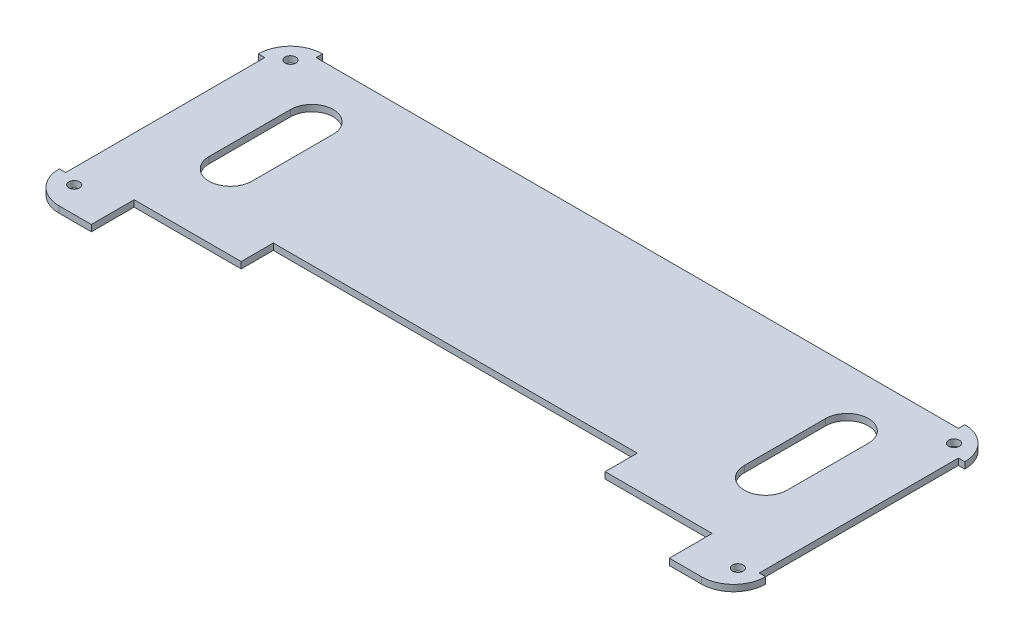
ISO-10303-21;
HEADER;
FILE_DESCRIPTION(('STEP AP214'),'2;1');
FILE_NAME('part.step','',(''),(''),'','','');
FILE_SCHEMA(('AUTOMOTIVE_DESIGN { 1 0 10303 214 1 1 1 1 }'));
ENDSEC;
DATA;
#1=APPLICATION_CONTEXT('core data for automotive mechanical design processes');
#2=APPLICATION_PROTOCOL_DEFINITION('international standard','automotive_design',2000,#1);
#3=PRODUCT_CONTEXT('',#1,'mechanical');
#4=PRODUCT('Part','Part','',(#3));
#5=PRODUCT_RELATED_PRODUCT_CATEGORY('part','',(#4));
#6=PRODUCT_DEFINITION_FORMATION('','',#4);
#7=PRODUCT_DEFINITION_CONTEXT('part definition',#1,'design');
#8=PRODUCT_DEFINITION('design','',#6,#7);
#9=PRODUCT_DEFINITION_SHAPE('','',#8);
#10=(LENGTH_UNIT() NAMED_UNIT(*) SI_UNIT(.MILLI.,.METRE.));
#11=(NAMED_UNIT(*) PLANE_ANGLE_UNIT() SI_UNIT($,.RADIAN.));
#12=(NAMED_UNIT(*) SI_UNIT($,.STERADIAN.) SOLID_ANGLE_UNIT());
#13=UNCERTAINTY_MEASURE_WITH_UNIT(LENGTH_MEASURE(1.E-05),#10,'distance_accuracy_value','');
#14=(GEOMETRIC_REPRESENTATION_CONTEXT(3) GLOBAL_UNCERTAINTY_ASSIGNED_CONTEXT((#13)) GLOBAL_UNIT_ASSIGNED_CONTEXT((#10,
#11,#12)) REPRESENTATION_CONTEXT('',''));
#15=CARTESIAN_POINT('',(0.,0.,0.));
#16=DIRECTION('',(0.,0.,1.));
#17=DIRECTION('',(1.,0.,0.));
#18=AXIS2_PLACEMENT_3D('',#15,#16,#17);
#19=CARTESIAN_POINT('',(0.,3.,-123.));
#20=DIRECTION('',(0.,-1.,0.));
#21=DIRECTION('',(0.,0.,-1.));
#22=AXIS2_PLACEMENT_3D('',#19,#20,#21);
#23=PLANE('',#22);
#24=CARTESIAN_POINT('',(40.,3.,-93.));
#25=DIRECTION('',(0.,1.,0.));
#26=DIRECTION('',(0.,0.,-1.));
#27=AXIS2_PLACEMENT_3D('',#24,#25,#26);
#28=CIRCLE('',#27,10.);
#29=CARTESIAN_POINT('',(50.,3.,-93.));
#30=VERTEX_POINT('',#29);
#31=CARTESIAN_POINT('',(30.,3.,-93.));
#32=VERTEX_POINT('',#31);
#33=EDGE_CURVE('E353',#30,#32,#28,.T.);
#34=ORIENTED_EDGE('',*,*,#33,.F.);
#35=DIRECTION('',(0.,0.,-1.));
#36=VECTOR('',#35,1.);
#37=CARTESIAN_POINT('',(50.,3.,-93.));
#38=LINE('',#37,#36);
#39=CARTESIAN_POINT('',(50.,3.,-55.));
#40=VERTEX_POINT('',#39);
#41=EDGE_CURVE('E361',#40,#30,#38,.T.);
#42=ORIENTED_EDGE('',*,*,#41,.F.);
#43=CARTESIAN_POINT('',(40.,3.,-55.));
#44=DIRECTION('',(0.,1.,0.));
#45=DIRECTION('',(0.,0.,1.));
#46=AXIS2_PLACEMENT_3D('',#43,#44,#45);
#47=CIRCLE('',#46,10.);
#48=CARTESIAN_POINT('',(30.,3.,-55.));
#49=VERTEX_POINT('',#48);
#50=EDGE_CURVE('E358',#49,#40,#47,.T.);
#51=ORIENTED_EDGE('',*,*,#50,.F.);
#52=DIRECTION('',(0.,0.,1.));
#53=VECTOR('',#52,1.);
#54=CARTESIAN_POINT('',(30.,3.,-93.));
#55=LINE('',#54,#53);
#56=EDGE_CURVE('E355',#32,#49,#55,.T.);
#57=ORIENTED_EDGE('',*,*,#56,.F.);
#58=EDGE_LOOP('',(#34,#42,#51,#57));
#59=FACE_BOUND('',#58,.T.);
#60=CARTESIAN_POINT('',(10.,3.,-12.));
#61=DIRECTION('',(0.,1.,0.));
#62=DIRECTION('',(0.,0.,1.));
#63=AXIS2_PLACEMENT_3D('',#60,#61,#62);
#64=CIRCLE('',#63,2.5);
#65=CARTESIAN_POINT('',(10.,3.,-9.5));
#66=VERTEX_POINT('',#65);
#67=EDGE_CURVE('E390',#66,#66,#64,.T.);
#68=ORIENTED_EDGE('',*,*,#67,.F.);
#69=EDGE_LOOP('',(#68));
#70=FACE_BOUND('',#69,.T.);
#71=CARTESIAN_POINT('',(10.,3.,-113.));
#72=DIRECTION('',(0.,1.,0.));
#73=DIRECTION('',(0.,0.,1.));
#74=AXIS2_PLACEMENT_3D('',#71,#72,#73);
#75=CIRCLE('',#74,2.5);
#76=CARTESIAN_POINT('',(10.,3.,-110.5));
#77=VERTEX_POINT('',#76);
#78=EDGE_CURVE('E402',#77,#77,#75,.T.);
#79=ORIENTED_EDGE('',*,*,#78,.F.);
#80=EDGE_LOOP('',(#79));
#81=FACE_BOUND('',#80,.T.);
#82=CARTESIAN_POINT('',(315.,3.,-15.));
#83=DIRECTION('',(0.,-1.,0.));
#84=DIRECTION('',(0.,0.,-1.));
#85=AXIS2_PLACEMENT_3D('',#82,#83,#84);
#86=CIRCLE('',#85,15.);
#87=CARTESIAN_POINT('',(315.,3.,0.));
#88=VERTEX_POINT('',#87);
#89=CARTESIAN_POINT('',(330.,3.,-15.0000000000001));
#90=VERTEX_POINT('',#89);
#91=EDGE_CURVE('E270',#88,#90,#86,.F.);
#92=ORIENTED_EDGE('',*,*,#91,.T.);
#93=DIRECTION('',(1.,0.,0.));
#94=VECTOR('',#93,1.);
#95=CARTESIAN_POINT('',(327.,3.,-15.0000000000001));
#96=LINE('',#95,#94);
#97=CARTESIAN_POINT('',(327.,3.,-15.0000000000001));
#98=VERTEX_POINT('',#97);
#99=EDGE_CURVE('E234',#98,#90,#96,.T.);
#100=ORIENTED_EDGE('',*,*,#99,.F.);
#101=DIRECTION('',(0.,0.,1.));
#102=VECTOR('',#101,1.);
#103=CARTESIAN_POINT('',(327.,3.,-108.));
#104=LINE('',#103,#102);
#105=CARTESIAN_POINT('',(327.,3.,-108.));
#106=VERTEX_POINT('',#105);
#107=EDGE_CURVE('E570',#106,#98,#104,.T.);
#108=ORIENTED_EDGE('',*,*,#107,.F.);
#109=DIRECTION('',(-1.,0.,0.));
#110=VECTOR('',#109,1.);
#111=CARTESIAN_POINT('',(330.,3.,-108.));
#112=LINE('',#111,#110);
#113=CARTESIAN_POINT('',(330.,3.,-108.));
#114=VERTEX_POINT('',#113);
#115=EDGE_CURVE('E568',#114,#106,#112,.T.);
#116=ORIENTED_EDGE('',*,*,#115,.F.);
#117=CARTESIAN_POINT('',(315.,3.,-108.));
#118=DIRECTION('',(0.,-1.,0.));
#119=DIRECTION('',(0.,0.,-1.));
#120=AXIS2_PLACEMENT_3D('',#117,#118,#119);
#121=CIRCLE('',#120,15.);
#122=CARTESIAN_POINT('',(315.,3.,-123.));
#123=VERTEX_POINT('',#122);
#124=EDGE_CURVE('E267',#114,#123,#121,.F.);
#125=ORIENTED_EDGE('',*,*,#124,.T.);
#126=DIRECTION('',(0.,0.,-1.));
#127=VECTOR('',#126,1.);
#128=CARTESIAN_POINT('',(315.,3.,-123.));
#129=LINE('',#128,#127);
#130=CARTESIAN_POINT('',(315.,3.,-120.));
#131=VERTEX_POINT('',#130);
#132=EDGE_CURVE('E565',#131,#123,#129,.T.);
#133=ORIENTED_EDGE('',*,*,#132,.F.);
#134=DIRECTION('',(1.,0.,0.));
#135=VECTOR('',#134,1.);
#136=CARTESIAN_POINT('',(15.,3.,-120.));
#137=LINE('',#136,#135);
#138=CARTESIAN_POINT('',(15.,3.,-120.));
#139=VERTEX_POINT('',#138);
#140=EDGE_CURVE('E294',#139,#131,#137,.T.);
#141=ORIENTED_EDGE('',*,*,#140,.F.);
#142=DIRECTION('',(0.,0.,1.));
#143=VECTOR('',#142,1.);
#144=CARTESIAN_POINT('',(15.,3.,-123.));
#145=LINE('',#144,#143);
#146=CARTESIAN_POINT('',(15.,3.,-123.));
#147=VERTEX_POINT('',#146);
#148=EDGE_CURVE('E281',#147,#139,#145,.T.);
#149=ORIENTED_EDGE('',*,*,#148,.F.);
#150=CARTESIAN_POINT('',(15.,3.,-108.));
#151=DIRECTION('',(0.,-1.,0.));
#152=DIRECTION('',(0.,0.,-1.));
#153=AXIS2_PLACEMENT_3D('',#150,#151,#152);
#154=CIRCLE('',#153,15.);
#155=CARTESIAN_POINT('',(0.,3.,-108.));
#156=VERTEX_POINT('',#155);
#157=EDGE_CURVE('E265',#147,#156,#154,.F.);
#158=ORIENTED_EDGE('',*,*,#157,.T.);
#159=DIRECTION('',(-1.,0.,0.));
#160=VECTOR('',#159,1.);
#161=CARTESIAN_POINT('',(0.,3.,-108.));
#162=LINE('',#161,#160);
#163=CARTESIAN_POINT('',(3.,3.,-108.));
#164=VERTEX_POINT('',#163);
#165=EDGE_CURVE('E54',#164,#156,#162,.T.);
#166=ORIENTED_EDGE('',*,*,#165,.F.);
#167=DIRECTION('',(0.,0.,-1.));
#168=VECTOR('',#167,1.);
#169=CARTESIAN_POINT('',(3.,3.,-108.));
#170=LINE('',#169,#168);
#171=CARTESIAN_POINT('',(3.00000000000001,3.,-15.));
#172=VERTEX_POINT('',#171);
#173=EDGE_CURVE('E307',#172,#164,#170,.T.);
#174=ORIENTED_EDGE('',*,*,#173,.F.);
#175=DIRECTION('',(1.,0.,0.));
#176=VECTOR('',#175,1.);
#177=CARTESIAN_POINT('',(3.00000000000001,3.,-15.));
#178=LINE('',#177,#176);
#179=CARTESIAN_POINT('',(0.,3.,-15.));
#180=VERTEX_POINT('',#179);
#181=EDGE_CURVE('E304',#180,#172,#178,.T.);
#182=ORIENTED_EDGE('',*,*,#181,.F.);
#183=CARTESIAN_POINT('',(15.,3.,-15.));
#184=DIRECTION('',(0.,-1.,0.));
#185=DIRECTION('',(0.,0.,-1.));
#186=AXIS2_PLACEMENT_3D('',#183,#184,#185);
#187=CIRCLE('',#186,15.);
#188=CARTESIAN_POINT('',(15.,3.,0.));
#189=VERTEX_POINT('',#188);
#190=EDGE_CURVE('E272',#180,#189,#187,.F.);
#191=ORIENTED_EDGE('',*,*,#190,.T.);
#192=DIRECTION('',(1.,0.,0.));
#193=VECTOR('',#192,1.);
#194=CARTESIAN_POINT('',(0.,3.,0.));
#195=LINE('',#194,#193);
#196=CARTESIAN_POINT('',(30.,3.,0.));
#197=VERTEX_POINT('',#196);
#198=EDGE_CURVE('E408',#189,#197,#195,.T.);
#199=ORIENTED_EDGE('',*,*,#198,.T.);
#200=DIRECTION('',(0.,0.,-1.));
#201=VECTOR('',#200,1.);
#202=CARTESIAN_POINT('',(30.,3.,0.));
#203=LINE('',#202,#201);
#204=CARTESIAN_POINT('',(30.,3.,-20.));
#205=VERTEX_POINT('',#204);
#206=EDGE_CURVE('E410',#197,#205,#203,.T.);
#207=ORIENTED_EDGE('',*,*,#206,.T.);
#208=DIRECTION('',(1.,0.,0.));
#209=VECTOR('',#208,1.);
#210=CARTESIAN_POINT('',(30.,3.,-20.));
#211=LINE('',#210,#209);
#212=CARTESIAN_POINT('',(80.,3.,-20.));
#213=VERTEX_POINT('',#212);
#214=EDGE_CURVE('E413',#205,#213,#211,.T.);
#215=ORIENTED_EDGE('',*,*,#214,.T.);
#216=DIRECTION('',(0.,0.,-1.));
#217=VECTOR('',#216,1.);
#218=CARTESIAN_POINT('',(80.,3.,-20.));
#219=LINE('',#218,#217);
#220=CARTESIAN_POINT('',(80.,3.,-35.));
#221=VERTEX_POINT('',#220);
#222=EDGE_CURVE('E415',#213,#221,#219,.T.);
#223=ORIENTED_EDGE('',*,*,#222,.T.);
#224=DIRECTION('',(1.,0.,0.));
#225=VECTOR('',#224,1.);
#226=CARTESIAN_POINT('',(80.,3.,-35.));
#227=LINE('',#226,#225);
#228=CARTESIAN_POINT('',(250.,3.,-35.));
#229=VERTEX_POINT('',#228);
#230=EDGE_CURVE('E417',#221,#229,#227,.T.);
#231=ORIENTED_EDGE('',*,*,#230,.T.);
#232=DIRECTION('',(0.,0.,1.));
#233=VECTOR('',#232,1.);
#234=CARTESIAN_POINT('',(250.,3.,-20.));
#235=LINE('',#234,#233);
#236=CARTESIAN_POINT('',(250.,3.,-20.));
#237=VERTEX_POINT('',#236);
#238=EDGE_CURVE('E419',#229,#237,#235,.T.);
#239=ORIENTED_EDGE('',*,*,#238,.T.);
#240=DIRECTION('',(1.,0.,0.));
#241=VECTOR('',#240,1.);
#242=CARTESIAN_POINT('',(300.,3.,-20.));
#243=LINE('',#242,#241);
#244=CARTESIAN_POINT('',(300.,3.,-20.));
#245=VERTEX_POINT('',#244);
#246=EDGE_CURVE('E421',#237,#245,#243,.T.);
#247=ORIENTED_EDGE('',*,*,#246,.T.);
#248=DIRECTION('',(0.,0.,1.));
#249=VECTOR('',#248,1.);
#250=CARTESIAN_POINT('',(300.,3.,0.));
#251=LINE('',#250,#249);
#252=CARTESIAN_POINT('',(300.,3.,0.));
#253=VERTEX_POINT('',#252);
#254=EDGE_CURVE('E423',#245,#253,#251,.T.);
#255=ORIENTED_EDGE('',*,*,#254,.T.);
#256=DIRECTION('',(1.,0.,0.));
#257=VECTOR('',#256,1.);
#258=CARTESIAN_POINT('',(330.,3.,0.));
#259=LINE('',#258,#257);
#260=EDGE_CURVE('E425',#253,#88,#259,.T.);
#261=ORIENTED_EDGE('',*,*,#260,.T.);
#262=EDGE_LOOP('',(#92,#100,#108,#116,#125,#133,#141,#149,#158,#166,#174,#182,#191,#199,#207,
#215,#223,#231,#239,#247,#255,#261));
#263=FACE_BOUND('',#262,.T.);
#264=CARTESIAN_POINT('',(320.,3.,-113.));
#265=DIRECTION('',(0.,1.,0.));
#266=DIRECTION('',(0.,0.,-1.));
#267=AXIS2_PLACEMENT_3D('',#264,#265,#266);
#268=CIRCLE('',#267,2.50000000000002);
#269=CARTESIAN_POINT('',(320.,3.,-115.5));
#270=VERTEX_POINT('',#269);
#271=EDGE_CURVE('E396',#270,#270,#268,.T.);
#272=ORIENTED_EDGE('',*,*,#271,.F.);
#273=EDGE_LOOP('',(#272));
#274=FACE_BOUND('',#273,.T.);
#275=CARTESIAN_POINT('',(320.,3.,-12.));
#276=DIRECTION('',(0.,1.,0.));
#277=DIRECTION('',(0.,0.,-1.));
#278=AXIS2_PLACEMENT_3D('',#275,#276,#277);
#279=CIRCLE('',#278,2.49999999999997);
#280=CARTESIAN_POINT('',(320.,3.,-14.5));
#281=VERTEX_POINT('',#280);
#282=EDGE_CURVE('E384',#281,#281,#279,.T.);
#283=ORIENTED_EDGE('',*,*,#282,.F.);
#284=EDGE_LOOP('',(#283));
#285=FACE_BOUND('',#284,.T.);
#286=CARTESIAN_POINT('',(290.,3.,-93.));
#287=DIRECTION('',(0.,1.,0.));
#288=DIRECTION('',(0.,0.,1.));
#289=AXIS2_PLACEMENT_3D('',#286,#287,#288);
#290=CIRCLE('',#289,10.);
#291=CARTESIAN_POINT('',(300.,3.,-93.));
#292=VERTEX_POINT('',#291);
#293=CARTESIAN_POINT('',(280.,3.,-93.));
#294=VERTEX_POINT('',#293);
#295=EDGE_CURVE('E322',#292,#294,#290,.T.);
#296=ORIENTED_EDGE('',*,*,#295,.F.);
#297=DIRECTION('',(0.,0.,-1.));
#298=VECTOR('',#297,1.);
#299=CARTESIAN_POINT('',(300.,3.,-93.));
#300=LINE('',#299,#298);
#301=CARTESIAN_POINT('',(300.,3.,-55.));
#302=VERTEX_POINT('',#301);
#303=EDGE_CURVE('E330',#302,#292,#300,.T.);
#304=ORIENTED_EDGE('',*,*,#303,.F.);
#305=CARTESIAN_POINT('',(290.,3.,-55.));
#306=DIRECTION('',(0.,1.,0.));
#307=DIRECTION('',(0.,0.,-1.));
#308=AXIS2_PLACEMENT_3D('',#305,#306,#307);
#309=CIRCLE('',#308,10.);
#310=CARTESIAN_POINT('',(280.,3.,-55.));
#311=VERTEX_POINT('',#310);
#312=EDGE_CURVE('E327',#311,#302,#309,.T.);
#313=ORIENTED_EDGE('',*,*,#312,.F.);
#314=DIRECTION('',(0.,0.,1.));
#315=VECTOR('',#314,1.);
#316=CARTESIAN_POINT('',(280.,3.,-93.));
#317=LINE('',#316,#315);
#318=EDGE_CURVE('E324',#294,#311,#317,.T.);
#319=ORIENTED_EDGE('',*,*,#318,.F.);
#320=EDGE_LOOP('',(#296,#304,#313,#319));
#321=FACE_BOUND('',#320,.T.);
#322=ADVANCED_FACE('F31',(#59,#70,#81,#263,#274,#285,#321),#23,.F.);
#323=CARTESIAN_POINT('',(0.,0.,-123.));
#324=DIRECTION('',(0.,-1.,0.));
#325=DIRECTION('',(0.,0.,-1.));
#326=AXIS2_PLACEMENT_3D('',#323,#324,#325);
#327=PLANE('',#326);
#328=DIRECTION('',(1.,0.,0.));
#329=VECTOR('',#328,1.);
#330=CARTESIAN_POINT('',(327.,0.,-15.0000000000001));
#331=LINE('',#330,#329);
#332=CARTESIAN_POINT('',(327.,0.,-15.0000000000001));
#333=VERTEX_POINT('',#332);
#334=CARTESIAN_POINT('',(330.,0.,-15.));
#335=VERTEX_POINT('',#334);
#336=EDGE_CURVE('E231',#333,#335,#331,.T.);
#337=ORIENTED_EDGE('',*,*,#336,.T.);
#338=CARTESIAN_POINT('',(315.,0.,-15.));
#339=DIRECTION('',(0.,-1.,0.));
#340=DIRECTION('',(0.,0.,-1.));
#341=AXIS2_PLACEMENT_3D('',#338,#339,#340);
#342=CIRCLE('',#341,15.);
#343=CARTESIAN_POINT('',(315.,0.,0.));
#344=VERTEX_POINT('',#343);
#345=EDGE_CURVE('E246',#335,#344,#342,.T.);
#346=ORIENTED_EDGE('',*,*,#345,.T.);
#347=DIRECTION('',(1.,0.,0.));
#348=VECTOR('',#347,1.);
#349=CARTESIAN_POINT('',(330.,0.,0.));
#350=LINE('',#349,#348);
#351=CARTESIAN_POINT('',(300.,0.,0.));
#352=VERTEX_POINT('',#351);
#353=EDGE_CURVE('E411',#352,#344,#350,.T.);
#354=ORIENTED_EDGE('',*,*,#353,.F.);
#355=DIRECTION('',(0.,0.,1.));
#356=VECTOR('',#355,1.);
#357=CARTESIAN_POINT('',(300.,0.,0.));
#358=LINE('',#357,#356);
#359=CARTESIAN_POINT('',(300.,0.,-20.));
#360=VERTEX_POINT('',#359);
#361=EDGE_CURVE('E441',#360,#352,#358,.T.);
#362=ORIENTED_EDGE('',*,*,#361,.F.);
#363=DIRECTION('',(1.,0.,0.));
#364=VECTOR('',#363,1.);
#365=CARTESIAN_POINT('',(300.,0.,-20.));
#366=LINE('',#365,#364);
#367=CARTESIAN_POINT('',(250.,0.,-20.));
#368=VERTEX_POINT('',#367);
#369=EDGE_CURVE('E439',#368,#360,#366,.T.);
#370=ORIENTED_EDGE('',*,*,#369,.F.);
#371=DIRECTION('',(0.,0.,1.));
#372=VECTOR('',#371,1.);
#373=CARTESIAN_POINT('',(250.,0.,-20.));
#374=LINE('',#373,#372);
#375=CARTESIAN_POINT('',(250.,0.,-35.));
#376=VERTEX_POINT('',#375);
#377=EDGE_CURVE('E437',#376,#368,#374,.T.);
#378=ORIENTED_EDGE('',*,*,#377,.F.);
#379=DIRECTION('',(1.,0.,0.));
#380=VECTOR('',#379,1.);
#381=CARTESIAN_POINT('',(80.,0.,-35.));
#382=LINE('',#381,#380);
#383=CARTESIAN_POINT('',(80.,0.,-35.));
#384=VERTEX_POINT('',#383);
#385=EDGE_CURVE('E435',#384,#376,#382,.T.);
#386=ORIENTED_EDGE('',*,*,#385,.F.);
#387=DIRECTION('',(0.,0.,-1.));
#388=VECTOR('',#387,1.);
#389=CARTESIAN_POINT('',(80.,0.,-20.));
#390=LINE('',#389,#388);
#391=CARTESIAN_POINT('',(80.,0.,-20.));
#392=VERTEX_POINT('',#391);
#393=EDGE_CURVE('E433',#392,#384,#390,.T.);
#394=ORIENTED_EDGE('',*,*,#393,.F.);
#395=DIRECTION('',(1.,0.,0.));
#396=VECTOR('',#395,1.);
#397=CARTESIAN_POINT('',(30.,0.,-20.));
#398=LINE('',#397,#396);
#399=CARTESIAN_POINT('',(30.,0.,-20.));
#400=VERTEX_POINT('',#399);
#401=EDGE_CURVE('E431',#400,#392,#398,.T.);
#402=ORIENTED_EDGE('',*,*,#401,.F.);
#403=DIRECTION('',(0.,0.,-1.));
#404=VECTOR('',#403,1.);
#405=CARTESIAN_POINT('',(30.,0.,0.));
#406=LINE('',#405,#404);
#407=CARTESIAN_POINT('',(30.,0.,0.));
#408=VERTEX_POINT('',#407);
#409=EDGE_CURVE('E429',#408,#400,#406,.T.);
#410=ORIENTED_EDGE('',*,*,#409,.F.);
#411=DIRECTION('',(1.,0.,0.));
#412=VECTOR('',#411,1.);
#413=CARTESIAN_POINT('',(0.,0.,0.));
#414=LINE('',#413,#412);
#415=CARTESIAN_POINT('',(15.,0.,0.));
#416=VERTEX_POINT('',#415);
#417=EDGE_CURVE('E405',#416,#408,#414,.T.);
#418=ORIENTED_EDGE('',*,*,#417,.F.);
#419=CARTESIAN_POINT('',(15.,0.,-15.));
#420=DIRECTION('',(0.,-1.,0.));
#421=DIRECTION('',(0.,0.,-1.));
#422=AXIS2_PLACEMENT_3D('',#419,#420,#421);
#423=CIRCLE('',#422,15.);
#424=CARTESIAN_POINT('',(0.,0.,-15.));
#425=VERTEX_POINT('',#424);
#426=EDGE_CURVE('E251',#416,#425,#423,.T.);
#427=ORIENTED_EDGE('',*,*,#426,.T.);
#428=DIRECTION('',(1.,0.,0.));
#429=VECTOR('',#428,1.);
#430=CARTESIAN_POINT('',(3.00000000000001,0.,-15.));
#431=LINE('',#430,#429);
#432=CARTESIAN_POINT('',(3.00000000000001,0.,-15.));
#433=VERTEX_POINT('',#432);
#434=EDGE_CURVE('E318',#425,#433,#431,.T.);
#435=ORIENTED_EDGE('',*,*,#434,.T.);
#436=DIRECTION('',(0.,0.,-1.));
#437=VECTOR('',#436,1.);
#438=CARTESIAN_POINT('',(3.,0.,-108.));
#439=LINE('',#438,#437);
#440=CARTESIAN_POINT('',(3.,0.,-108.));
#441=VERTEX_POINT('',#440);
#442=EDGE_CURVE('E303',#433,#441,#439,.T.);
#443=ORIENTED_EDGE('',*,*,#442,.T.);
#444=DIRECTION('',(-1.,0.,0.));
#445=VECTOR('',#444,1.);
#446=CARTESIAN_POINT('',(0.,0.,-108.));
#447=LINE('',#446,#445);
#448=CARTESIAN_POINT('',(0.,0.,-108.));
#449=VERTEX_POINT('',#448);
#450=EDGE_CURVE('E299',#441,#449,#447,.T.);
#451=ORIENTED_EDGE('',*,*,#450,.T.);
#452=CARTESIAN_POINT('',(15.,0.,-108.));
#453=DIRECTION('',(0.,-1.,0.));
#454=DIRECTION('',(0.,0.,-1.));
#455=AXIS2_PLACEMENT_3D('',#452,#453,#454);
#456=CIRCLE('',#455,15.);
#457=CARTESIAN_POINT('',(15.,0.,-123.));
#458=VERTEX_POINT('',#457);
#459=EDGE_CURVE('E258',#449,#458,#456,.T.);
#460=ORIENTED_EDGE('',*,*,#459,.T.);
#461=DIRECTION('',(0.,0.,1.));
#462=VECTOR('',#461,1.);
#463=CARTESIAN_POINT('',(15.,0.,-123.));
#464=LINE('',#463,#462);
#465=CARTESIAN_POINT('',(15.,0.,-120.));
#466=VERTEX_POINT('',#465);
#467=EDGE_CURVE('E284',#458,#466,#464,.T.);
#468=ORIENTED_EDGE('',*,*,#467,.T.);
#469=DIRECTION('',(1.,0.,0.));
#470=VECTOR('',#469,1.);
#471=CARTESIAN_POINT('',(15.,0.,-120.));
#472=LINE('',#471,#470);
#473=CARTESIAN_POINT('',(315.,0.,-120.));
#474=VERTEX_POINT('',#473);
#475=EDGE_CURVE('E580',#466,#474,#472,.T.);
#476=ORIENTED_EDGE('',*,*,#475,.T.);
#477=DIRECTION('',(0.,0.,-1.));
#478=VECTOR('',#477,1.);
#479=CARTESIAN_POINT('',(315.,0.,-123.));
#480=LINE('',#479,#478);
#481=CARTESIAN_POINT('',(315.,0.,-123.));
#482=VERTEX_POINT('',#481);
#483=EDGE_CURVE('E295',#474,#482,#480,.T.);
#484=ORIENTED_EDGE('',*,*,#483,.T.);
#485=CARTESIAN_POINT('',(315.,0.,-108.));
#486=DIRECTION('',(0.,-1.,0.));
#487=DIRECTION('',(0.,0.,-1.));
#488=AXIS2_PLACEMENT_3D('',#485,#486,#487);
#489=CIRCLE('',#488,15.);
#490=CARTESIAN_POINT('',(330.,0.,-108.));
#491=VERTEX_POINT('',#490);
#492=EDGE_CURVE('E252',#482,#491,#489,.T.);
#493=ORIENTED_EDGE('',*,*,#492,.T.);
#494=DIRECTION('',(-1.,0.,0.));
#495=VECTOR('',#494,1.);
#496=CARTESIAN_POINT('',(330.,0.,-108.));
#497=LINE('',#496,#495);
#498=CARTESIAN_POINT('',(327.,0.,-108.));
#499=VERTEX_POINT('',#498);
#500=EDGE_CURVE('E618',#491,#499,#497,.T.);
#501=ORIENTED_EDGE('',*,*,#500,.T.);
#502=DIRECTION('',(0.,0.,1.));
#503=VECTOR('',#502,1.);
#504=CARTESIAN_POINT('',(327.,0.,-108.));
#505=LINE('',#504,#503);
#506=EDGE_CURVE('E248',#499,#333,#505,.T.);
#507=ORIENTED_EDGE('',*,*,#506,.T.);
#508=EDGE_LOOP('',(#337,#346,#354,#362,#370,#378,#386,#394,#402,#410,#418,#427,#435,#443,#451,
#460,#468,#476,#484,#493,#501,#507));
#509=FACE_BOUND('',#508,.T.);
#510=DIRECTION('',(0.,0.,-1.));
#511=VECTOR('',#510,1.);
#512=CARTESIAN_POINT('',(50.,0.,-93.));
#513=LINE('',#512,#511);
#514=CARTESIAN_POINT('',(50.,0.,-55.));
#515=VERTEX_POINT('',#514);
#516=CARTESIAN_POINT('',(50.,0.,-93.));
#517=VERTEX_POINT('',#516);
#518=EDGE_CURVE('E356',#515,#517,#513,.T.);
#519=ORIENTED_EDGE('',*,*,#518,.T.);
#520=CARTESIAN_POINT('',(40.,0.,-93.));
#521=DIRECTION('',(0.,1.,0.));
#522=DIRECTION('',(0.,0.,-1.));
#523=AXIS2_PLACEMENT_3D('',#520,#521,#522);
#524=CIRCLE('',#523,10.);
#525=CARTESIAN_POINT('',(30.,0.,-93.));
#526=VERTEX_POINT('',#525);
#527=EDGE_CURVE('E352',#517,#526,#524,.T.);
#528=ORIENTED_EDGE('',*,*,#527,.T.);
#529=DIRECTION('',(0.,0.,1.));
#530=VECTOR('',#529,1.);
#531=CARTESIAN_POINT('',(30.,0.,-93.));
#532=LINE('',#531,#530);
#533=CARTESIAN_POINT('',(30.,0.,-55.));
#534=VERTEX_POINT('',#533);
#535=EDGE_CURVE('E366',#526,#534,#532,.T.);
#536=ORIENTED_EDGE('',*,*,#535,.T.);
#537=CARTESIAN_POINT('',(40.,0.,-55.));
#538=DIRECTION('',(0.,1.,0.));
#539=DIRECTION('',(0.,0.,1.));
#540=AXIS2_PLACEMENT_3D('',#537,#538,#539);
#541=CIRCLE('',#540,10.);
#542=EDGE_CURVE('E369',#534,#515,#541,.T.);
#543=ORIENTED_EDGE('',*,*,#542,.T.);
#544=EDGE_LOOP('',(#519,#528,#536,#543));
#545=FACE_BOUND('',#544,.T.);
#546=CARTESIAN_POINT('',(10.,0.,-12.));
#547=DIRECTION('',(0.,1.,0.));
#548=DIRECTION('',(0.,0.,1.));
#549=AXIS2_PLACEMENT_3D('',#546,#547,#548);
#550=CIRCLE('',#549,2.5);
#551=CARTESIAN_POINT('',(10.,0.,-9.5));
#552=VERTEX_POINT('',#551);
#553=EDGE_CURVE('E387',#552,#552,#550,.T.);
#554=ORIENTED_EDGE('',*,*,#553,.T.);
#555=EDGE_LOOP('',(#554));
#556=FACE_BOUND('',#555,.T.);
#557=CARTESIAN_POINT('',(10.,0.,-113.));
#558=DIRECTION('',(0.,1.,0.));
#559=DIRECTION('',(0.,0.,1.));
#560=AXIS2_PLACEMENT_3D('',#557,#558,#559);
#561=CIRCLE('',#560,2.5);
#562=CARTESIAN_POINT('',(10.,0.,-110.5));
#563=VERTEX_POINT('',#562);
#564=EDGE_CURVE('E399',#563,#563,#561,.T.);
#565=ORIENTED_EDGE('',*,*,#564,.T.);
#566=EDGE_LOOP('',(#565));
#567=FACE_BOUND('',#566,.T.);
#568=CARTESIAN_POINT('',(320.,0.,-113.));
#569=DIRECTION('',(0.,1.,0.));
#570=DIRECTION('',(0.,0.,-1.));
#571=AXIS2_PLACEMENT_3D('',#568,#569,#570);
#572=CIRCLE('',#571,2.50000000000002);
#573=CARTESIAN_POINT('',(320.,0.,-115.5));
#574=VERTEX_POINT('',#573);
#575=EDGE_CURVE('E393',#574,#574,#572,.T.);
#576=ORIENTED_EDGE('',*,*,#575,.T.);
#577=EDGE_LOOP('',(#576));
#578=FACE_BOUND('',#577,.T.);
#579=CARTESIAN_POINT('',(320.,0.,-12.));
#580=DIRECTION('',(0.,1.,0.));
#581=DIRECTION('',(0.,0.,-1.));
#582=AXIS2_PLACEMENT_3D('',#579,#580,#581);
#583=CIRCLE('',#582,2.49999999999997);
#584=CARTESIAN_POINT('',(320.,0.,-14.5));
#585=VERTEX_POINT('',#584);
#586=EDGE_CURVE('E383',#585,#585,#583,.T.);
#587=ORIENTED_EDGE('',*,*,#586,.T.);
#588=EDGE_LOOP('',(#587));
#589=FACE_BOUND('',#588,.T.);
#590=DIRECTION('',(0.,0.,-1.));
#591=VECTOR('',#590,1.);
#592=CARTESIAN_POINT('',(300.,0.,-93.));
#593=LINE('',#592,#591);
#594=CARTESIAN_POINT('',(300.,0.,-55.));
#595=VERTEX_POINT('',#594);
#596=CARTESIAN_POINT('',(300.,0.,-93.));
#597=VERTEX_POINT('',#596);
#598=EDGE_CURVE('E325',#595,#597,#593,.T.);
#599=ORIENTED_EDGE('',*,*,#598,.T.);
#600=CARTESIAN_POINT('',(290.,0.,-93.));
#601=DIRECTION('',(0.,1.,0.));
#602=DIRECTION('',(0.,0.,1.));
#603=AXIS2_PLACEMENT_3D('',#600,#601,#602);
#604=CIRCLE('',#603,10.);
#605=CARTESIAN_POINT('',(280.,0.,-93.));
#606=VERTEX_POINT('',#605);
#607=EDGE_CURVE('E321',#597,#606,#604,.T.);
#608=ORIENTED_EDGE('',*,*,#607,.T.);
#609=DIRECTION('',(0.,0.,1.));
#610=VECTOR('',#609,1.);
#611=CARTESIAN_POINT('',(280.,0.,-93.));
#612=LINE('',#611,#610);
#613=CARTESIAN_POINT('',(280.,0.,-55.));
#614=VERTEX_POINT('',#613);
#615=EDGE_CURVE('E335',#606,#614,#612,.T.);
#616=ORIENTED_EDGE('',*,*,#615,.T.);
#617=CARTESIAN_POINT('',(290.,0.,-55.));
#618=DIRECTION('',(0.,1.,0.));
#619=DIRECTION('',(0.,0.,-1.));
#620=AXIS2_PLACEMENT_3D('',#617,#618,#619);
#621=CIRCLE('',#620,10.);
#622=EDGE_CURVE('E338',#614,#595,#621,.T.);
#623=ORIENTED_EDGE('',*,*,#622,.T.);
#624=EDGE_LOOP('',(#599,#608,#616,#623));
#625=FACE_BOUND('',#624,.T.);
#626=ADVANCED_FACE('F243',(#509,#545,#556,#567,#578,#589,#625),#327,.T.);
#627=CARTESIAN_POINT('',(0.,3.,0.));
#628=DIRECTION('',(0.,0.,-1.));
#629=DIRECTION('',(-1.,0.,0.));
#630=AXIS2_PLACEMENT_3D('',#627,#628,#629);
#631=PLANE('',#630);
#632=ORIENTED_EDGE('',*,*,#198,.F.);
#633=DIRECTION('',(0.,-1.,0.));
#634=VECTOR('',#633,1.);
#635=CARTESIAN_POINT('',(15.,3.,0.));
#636=LINE('',#635,#634);
#637=EDGE_CURVE('E467',#189,#416,#636,.T.);
#638=ORIENTED_EDGE('',*,*,#637,.T.);
#639=ORIENTED_EDGE('',*,*,#417,.T.);
#640=DIRECTION('',(0.,-1.,0.));
#641=VECTOR('',#640,1.);
#642=CARTESIAN_POINT('',(30.,3.,0.));
#643=LINE('',#642,#641);
#644=EDGE_CURVE('E464',#197,#408,#643,.T.);
#645=ORIENTED_EDGE('',*,*,#644,.F.);
#646=EDGE_LOOP('',(#632,#638,#639,#645));
#647=FACE_BOUND('',#646,.T.);
#648=ADVANCED_FACE('F473',(#647),#631,.F.);
#649=CARTESIAN_POINT('',(30.,3.,0.));
#650=DIRECTION('',(-1.,0.,0.));
#651=DIRECTION('',(0.,0.,1.));
#652=AXIS2_PLACEMENT_3D('',#649,#650,#651);
#653=PLANE('',#652);
#654=ORIENTED_EDGE('',*,*,#409,.T.);
#655=DIRECTION('',(0.,-1.,0.));
#656=VECTOR('',#655,1.);
#657=CARTESIAN_POINT('',(30.,3.,-20.));
#658=LINE('',#657,#656);
#659=EDGE_CURVE('E461',#205,#400,#658,.T.);
#660=ORIENTED_EDGE('',*,*,#659,.F.);
#661=ORIENTED_EDGE('',*,*,#206,.F.);
#662=ORIENTED_EDGE('',*,*,#644,.T.);
#663=EDGE_LOOP('',(#654,#660,#661,#662));
#664=FACE_BOUND('',#663,.T.);
#665=ADVANCED_FACE('F483',(#664),#653,.F.);
#666=CARTESIAN_POINT('',(30.,3.,-20.));
#667=DIRECTION('',(0.,0.,-1.));
#668=DIRECTION('',(-1.,0.,0.));
#669=AXIS2_PLACEMENT_3D('',#666,#667,#668);
#670=PLANE('',#669);
#671=ORIENTED_EDGE('',*,*,#401,.T.);
#672=DIRECTION('',(0.,-1.,0.));
#673=VECTOR('',#672,1.);
#674=CARTESIAN_POINT('',(80.,3.,-20.));
#675=LINE('',#674,#673);
#676=EDGE_CURVE('E458',#213,#392,#675,.T.);
#677=ORIENTED_EDGE('',*,*,#676,.F.);
#678=ORIENTED_EDGE('',*,*,#214,.F.);
#679=ORIENTED_EDGE('',*,*,#659,.T.);
#680=EDGE_LOOP('',(#671,#677,#678,#679));
#681=FACE_BOUND('',#680,.T.);
#682=ADVANCED_FACE('F487',(#681),#670,.F.);
#683=CARTESIAN_POINT('',(80.,3.,-20.));
#684=DIRECTION('',(-1.,0.,0.));
#685=DIRECTION('',(0.,0.,1.));
#686=AXIS2_PLACEMENT_3D('',#683,#684,#685);
#687=PLANE('',#686);
#688=ORIENTED_EDGE('',*,*,#393,.T.);
#689=DIRECTION('',(0.,-1.,0.));
#690=VECTOR('',#689,1.);
#691=CARTESIAN_POINT('',(80.,3.,-35.));
#692=LINE('',#691,#690);
#693=EDGE_CURVE('E455',#221,#384,#692,.T.);
#694=ORIENTED_EDGE('',*,*,#693,.F.);
#695=ORIENTED_EDGE('',*,*,#222,.F.);
#696=ORIENTED_EDGE('',*,*,#676,.T.);
#697=EDGE_LOOP('',(#688,#694,#695,#696));
#698=FACE_BOUND('',#697,.T.);
#699=ADVANCED_FACE('F539',(#698),#687,.F.);
#700=CARTESIAN_POINT('',(80.,3.,-35.));
#701=DIRECTION('',(0.,0.,-1.));
#702=DIRECTION('',(-1.,0.,0.));
#703=AXIS2_PLACEMENT_3D('',#700,#701,#702);
#704=PLANE('',#703);
#705=ORIENTED_EDGE('',*,*,#385,.T.);
#706=DIRECTION('',(0.,-1.,0.));
#707=VECTOR('',#706,1.);
#708=CARTESIAN_POINT('',(250.,3.,-35.));
#709=LINE('',#708,#707);
#710=EDGE_CURVE('E452',#229,#376,#709,.T.);
#711=ORIENTED_EDGE('',*,*,#710,.F.);
#712=ORIENTED_EDGE('',*,*,#230,.F.);
#713=ORIENTED_EDGE('',*,*,#693,.T.);
#714=EDGE_LOOP('',(#705,#711,#712,#713));
#715=FACE_BOUND('',#714,.T.);
#716=ADVANCED_FACE('F535',(#715),#704,.F.);
#717=CARTESIAN_POINT('',(250.,3.,-20.));
#718=DIRECTION('',(1.,0.,0.));
#719=DIRECTION('',(0.,0.,-1.));
#720=AXIS2_PLACEMENT_3D('',#717,#718,#719);
#721=PLANE('',#720);
#722=ORIENTED_EDGE('',*,*,#377,.T.);
#723=DIRECTION('',(0.,-1.,0.));
#724=VECTOR('',#723,1.);
#725=CARTESIAN_POINT('',(250.,3.,-20.));
#726=LINE('',#725,#724);
#727=EDGE_CURVE('E449',#237,#368,#726,.T.);
#728=ORIENTED_EDGE('',*,*,#727,.F.);
#729=ORIENTED_EDGE('',*,*,#238,.F.);
#730=ORIENTED_EDGE('',*,*,#710,.T.);
#731=EDGE_LOOP('',(#722,#728,#729,#730));
#732=FACE_BOUND('',#731,.T.);
#733=ADVANCED_FACE('F531',(#732),#721,.F.);
#734=CARTESIAN_POINT('',(300.,3.,-20.));
#735=DIRECTION('',(0.,0.,-1.));
#736=DIRECTION('',(-1.,0.,0.));
#737=AXIS2_PLACEMENT_3D('',#734,#735,#736);
#738=PLANE('',#737);
#739=ORIENTED_EDGE('',*,*,#369,.T.);
#740=DIRECTION('',(0.,-1.,0.));
#741=VECTOR('',#740,1.);
#742=CARTESIAN_POINT('',(300.,3.,-20.));
#743=LINE('',#742,#741);
#744=EDGE_CURVE('E446',#245,#360,#743,.T.);
#745=ORIENTED_EDGE('',*,*,#744,.F.);
#746=ORIENTED_EDGE('',*,*,#246,.F.);
#747=ORIENTED_EDGE('',*,*,#727,.T.);
#748=EDGE_LOOP('',(#739,#745,#746,#747));
#749=FACE_BOUND('',#748,.T.);
#750=ADVANCED_FACE('F527',(#749),#738,.F.);
#751=CARTESIAN_POINT('',(300.,3.,0.));
#752=DIRECTION('',(1.,0.,0.));
#753=DIRECTION('',(0.,0.,-1.));
#754=AXIS2_PLACEMENT_3D('',#751,#752,#753);
#755=PLANE('',#754);
#756=ORIENTED_EDGE('',*,*,#361,.T.);
#757=DIRECTION('',(0.,-1.,0.));
#758=VECTOR('',#757,1.);
#759=CARTESIAN_POINT('',(300.,3.,0.));
#760=LINE('',#759,#758);
#761=EDGE_CURVE('E427',#253,#352,#760,.T.);
#762=ORIENTED_EDGE('',*,*,#761,.F.);
#763=ORIENTED_EDGE('',*,*,#254,.F.);
#764=ORIENTED_EDGE('',*,*,#744,.T.);
#765=EDGE_LOOP('',(#756,#762,#763,#764));
#766=FACE_BOUND('',#765,.T.);
#767=ADVANCED_FACE('F524',(#766),#755,.F.);
#768=CARTESIAN_POINT('',(330.,3.,0.));
#769=DIRECTION('',(0.,0.,-1.));
#770=DIRECTION('',(-1.,0.,0.));
#771=AXIS2_PLACEMENT_3D('',#768,#769,#770);
#772=PLANE('',#771);
#773=ORIENTED_EDGE('',*,*,#353,.T.);
#774=DIRECTION('',(0.,-1.,0.));
#775=VECTOR('',#774,1.);
#776=CARTESIAN_POINT('',(315.,3.,0.));
#777=LINE('',#776,#775);
#778=EDGE_CURVE('E46',#344,#88,#777,.F.);
#779=ORIENTED_EDGE('',*,*,#778,.T.);
#780=ORIENTED_EDGE('',*,*,#260,.F.);
#781=ORIENTED_EDGE('',*,*,#761,.T.);
#782=EDGE_LOOP('',(#773,#779,#780,#781));
#783=FACE_BOUND('',#782,.T.);
#784=ADVANCED_FACE('F521',(#783),#772,.F.);
#785=CARTESIAN_POINT('',(10.,3.,-113.));
#786=DIRECTION('',(0.,-1.,0.));
#787=DIRECTION('',(0.,0.,-1.));
#788=AXIS2_PLACEMENT_3D('',#785,#786,#787);
#789=CYLINDRICAL_SURFACE('',#788,2.5);
#790=ORIENTED_EDGE('',*,*,#78,.T.);
#791=EDGE_LOOP('',(#790));
#792=FACE_BOUND('',#791,.T.);
#793=ORIENTED_EDGE('',*,*,#564,.F.);
#794=EDGE_LOOP('',(#793));
#795=FACE_BOUND('',#794,.T.);
#796=ADVANCED_FACE('F518',(#792,#795),#789,.F.);
#797=CARTESIAN_POINT('',(320.,3.,-113.));
#798=DIRECTION('',(0.,-1.,0.));
#799=DIRECTION('',(0.,0.,-1.));
#800=AXIS2_PLACEMENT_3D('',#797,#798,#799);
#801=CYLINDRICAL_SURFACE('',#800,2.50000000000002);
#802=ORIENTED_EDGE('',*,*,#271,.T.);
#803=EDGE_LOOP('',(#802));
#804=FACE_BOUND('',#803,.T.);
#805=ORIENTED_EDGE('',*,*,#575,.F.);
#806=EDGE_LOOP('',(#805));
#807=FACE_BOUND('',#806,.T.);
#808=ADVANCED_FACE('F820',(#804,#807),#801,.F.);
#809=CARTESIAN_POINT('',(10.,3.,-12.));
#810=DIRECTION('',(0.,-1.,0.));
#811=DIRECTION('',(0.,0.,-1.));
#812=AXIS2_PLACEMENT_3D('',#809,#810,#811);
#813=CYLINDRICAL_SURFACE('',#812,2.5);
#814=ORIENTED_EDGE('',*,*,#67,.T.);
#815=EDGE_LOOP('',(#814));
#816=FACE_BOUND('',#815,.T.);
#817=ORIENTED_EDGE('',*,*,#553,.F.);
#818=EDGE_LOOP('',(#817));
#819=FACE_BOUND('',#818,.T.);
#820=ADVANCED_FACE('F810',(#816,#819),#813,.F.);
#821=CARTESIAN_POINT('',(320.,3.,-12.));
#822=DIRECTION('',(0.,-1.,0.));
#823=DIRECTION('',(0.,0.,-1.));
#824=AXIS2_PLACEMENT_3D('',#821,#822,#823);
#825=CYLINDRICAL_SURFACE('',#824,2.49999999999997);
#826=ORIENTED_EDGE('',*,*,#282,.T.);
#827=EDGE_LOOP('',(#826));
#828=FACE_BOUND('',#827,.T.);
#829=ORIENTED_EDGE('',*,*,#586,.F.);
#830=EDGE_LOOP('',(#829));
#831=FACE_BOUND('',#830,.T.);
#832=ADVANCED_FACE('F800',(#828,#831),#825,.F.);
#833=CARTESIAN_POINT('',(40.,3.,-93.));
#834=DIRECTION('',(0.,-1.,0.));
#835=DIRECTION('',(0.,0.,-1.));
#836=AXIS2_PLACEMENT_3D('',#833,#834,#835);
#837=CYLINDRICAL_SURFACE('',#836,10.);
#838=ORIENTED_EDGE('',*,*,#527,.F.);
#839=DIRECTION('',(0.,-1.,0.));
#840=VECTOR('',#839,1.);
#841=CARTESIAN_POINT('',(50.,3.,-93.));
#842=LINE('',#841,#840);
#843=EDGE_CURVE('E363',#30,#517,#842,.T.);
#844=ORIENTED_EDGE('',*,*,#843,.F.);
#845=ORIENTED_EDGE('',*,*,#33,.T.);
#846=DIRECTION('',(0.,-1.,0.));
#847=VECTOR('',#846,1.);
#848=CARTESIAN_POINT('',(30.,3.,-93.));
#849=LINE('',#848,#847);
#850=EDGE_CURVE('E380',#32,#526,#849,.T.);
#851=ORIENTED_EDGE('',*,*,#850,.T.);
#852=EDGE_LOOP('',(#838,#844,#845,#851));
#853=FACE_BOUND('',#852,.T.);
#854=ADVANCED_FACE('F790',(#853),#837,.F.);
#855=CARTESIAN_POINT('',(30.,3.,-93.));
#856=DIRECTION('',(1.,0.,0.));
#857=DIRECTION('',(0.,0.,-1.));
#858=AXIS2_PLACEMENT_3D('',#855,#856,#857);
#859=PLANE('',#858);
#860=ORIENTED_EDGE('',*,*,#535,.F.);
#861=ORIENTED_EDGE('',*,*,#850,.F.);
#862=ORIENTED_EDGE('',*,*,#56,.T.);
#863=DIRECTION('',(0.,-1.,0.));
#864=VECTOR('',#863,1.);
#865=CARTESIAN_POINT('',(30.,3.,-55.));
#866=LINE('',#865,#864);
#867=EDGE_CURVE('E378',#49,#534,#866,.T.);
#868=ORIENTED_EDGE('',*,*,#867,.T.);
#869=EDGE_LOOP('',(#860,#861,#862,#868));
#870=FACE_BOUND('',#869,.T.);
#871=ADVANCED_FACE('F780',(#870),#859,.T.);
#872=CARTESIAN_POINT('',(40.,3.,-55.));
#873=DIRECTION('',(0.,-1.,0.));
#874=DIRECTION('',(0.,0.,-1.));
#875=AXIS2_PLACEMENT_3D('',#872,#873,#874);
#876=CYLINDRICAL_SURFACE('',#875,10.);
#877=ORIENTED_EDGE('',*,*,#542,.F.);
#878=ORIENTED_EDGE('',*,*,#867,.F.);
#879=ORIENTED_EDGE('',*,*,#50,.T.);
#880=DIRECTION('',(0.,-1.,0.));
#881=VECTOR('',#880,1.);
#882=CARTESIAN_POINT('',(50.,3.,-55.));
#883=LINE('',#882,#881);
#884=EDGE_CURVE('E376',#40,#515,#883,.T.);
#885=ORIENTED_EDGE('',*,*,#884,.T.);
#886=EDGE_LOOP('',(#877,#878,#879,#885));
#887=FACE_BOUND('',#886,.T.);
#888=ADVANCED_FACE('F770',(#887),#876,.F.);
#889=CARTESIAN_POINT('',(50.,3.,-93.));
#890=DIRECTION('',(-1.,0.,0.));
#891=DIRECTION('',(0.,0.,1.));
#892=AXIS2_PLACEMENT_3D('',#889,#890,#891);
#893=PLANE('',#892);
#894=ORIENTED_EDGE('',*,*,#518,.F.);
#895=ORIENTED_EDGE('',*,*,#884,.F.);
#896=ORIENTED_EDGE('',*,*,#41,.T.);
#897=ORIENTED_EDGE('',*,*,#843,.T.);
#898=EDGE_LOOP('',(#894,#895,#896,#897));
#899=FACE_BOUND('',#898,.T.);
#900=ADVANCED_FACE('F760',(#899),#893,.T.);
#901=CARTESIAN_POINT('',(290.,3.,-93.));
#902=DIRECTION('',(0.,-1.,0.));
#903=DIRECTION('',(0.,0.,-1.));
#904=AXIS2_PLACEMENT_3D('',#901,#902,#903);
#905=CYLINDRICAL_SURFACE('',#904,10.);
#906=ORIENTED_EDGE('',*,*,#607,.F.);
#907=DIRECTION('',(0.,-1.,0.));
#908=VECTOR('',#907,1.);
#909=CARTESIAN_POINT('',(300.,3.,-93.));
#910=LINE('',#909,#908);
#911=EDGE_CURVE('E332',#292,#597,#910,.T.);
#912=ORIENTED_EDGE('',*,*,#911,.F.);
#913=ORIENTED_EDGE('',*,*,#295,.T.);
#914=DIRECTION('',(0.,-1.,0.));
#915=VECTOR('',#914,1.);
#916=CARTESIAN_POINT('',(280.,3.,-93.));
#917=LINE('',#916,#915);
#918=EDGE_CURVE('E349',#294,#606,#917,.T.);
#919=ORIENTED_EDGE('',*,*,#918,.T.);
#920=EDGE_LOOP('',(#906,#912,#913,#919));
#921=FACE_BOUND('',#920,.T.);
#922=ADVANCED_FACE('F750',(#921),#905,.F.);
#923=CARTESIAN_POINT('',(280.,3.,-93.));
#924=DIRECTION('',(1.,0.,0.));
#925=DIRECTION('',(0.,0.,-1.));
#926=AXIS2_PLACEMENT_3D('',#923,#924,#925);
#927=PLANE('',#926);
#928=ORIENTED_EDGE('',*,*,#615,.F.);
#929=ORIENTED_EDGE('',*,*,#918,.F.);
#930=ORIENTED_EDGE('',*,*,#318,.T.);
#931=DIRECTION('',(0.,-1.,0.));
#932=VECTOR('',#931,1.);
#933=CARTESIAN_POINT('',(280.,3.,-55.));
#934=LINE('',#933,#932);
#935=EDGE_CURVE('E347',#311,#614,#934,.T.);
#936=ORIENTED_EDGE('',*,*,#935,.T.);
#937=EDGE_LOOP('',(#928,#929,#930,#936));
#938=FACE_BOUND('',#937,.T.);
#939=ADVANCED_FACE('F740',(#938),#927,.T.);
#940=CARTESIAN_POINT('',(290.,3.,-55.));
#941=DIRECTION('',(0.,-1.,0.));
#942=DIRECTION('',(0.,0.,-1.));
#943=AXIS2_PLACEMENT_3D('',#940,#941,#942);
#944=CYLINDRICAL_SURFACE('',#943,10.);
#945=ORIENTED_EDGE('',*,*,#622,.F.);
#946=ORIENTED_EDGE('',*,*,#935,.F.);
#947=ORIENTED_EDGE('',*,*,#312,.T.);
#948=DIRECTION('',(0.,-1.,0.));
#949=VECTOR('',#948,1.);
#950=CARTESIAN_POINT('',(300.,3.,-55.));
#951=LINE('',#950,#949);
#952=EDGE_CURVE('E345',#302,#595,#951,.T.);
#953=ORIENTED_EDGE('',*,*,#952,.T.);
#954=EDGE_LOOP('',(#945,#946,#947,#953));
#955=FACE_BOUND('',#954,.T.);
#956=ADVANCED_FACE('F730',(#955),#944,.F.);
#957=CARTESIAN_POINT('',(300.,3.,-93.));
#958=DIRECTION('',(-1.,0.,0.));
#959=DIRECTION('',(0.,0.,1.));
#960=AXIS2_PLACEMENT_3D('',#957,#958,#959);
#961=PLANE('',#960);
#962=ORIENTED_EDGE('',*,*,#598,.F.);
#963=ORIENTED_EDGE('',*,*,#952,.F.);
#964=ORIENTED_EDGE('',*,*,#303,.T.);
#965=ORIENTED_EDGE('',*,*,#911,.T.);
#966=EDGE_LOOP('',(#962,#963,#964,#965));
#967=FACE_BOUND('',#966,.T.);
#968=ADVANCED_FACE('F552',(#967),#961,.T.);
#969=CARTESIAN_POINT('',(15.,3.,-15.));
#970=DIRECTION('',(0.,-1.,0.));
#971=DIRECTION('',(0.,0.,-1.));
#972=AXIS2_PLACEMENT_3D('',#969,#970,#971);
#973=CYLINDRICAL_SURFACE('',#972,15.);
#974=ORIENTED_EDGE('',*,*,#190,.F.);
#975=DIRECTION('',(0.,-1.,0.));
#976=VECTOR('',#975,1.);
#977=CARTESIAN_POINT('',(0.,3.,-15.));
#978=LINE('',#977,#976);
#979=EDGE_CURVE('E263',#425,#180,#978,.F.);
#980=ORIENTED_EDGE('',*,*,#979,.F.);
#981=ORIENTED_EDGE('',*,*,#426,.F.);
#982=ORIENTED_EDGE('',*,*,#637,.F.);
#983=EDGE_LOOP('',(#974,#980,#981,#982));
#984=FACE_BOUND('',#983,.T.);
#985=ADVANCED_FACE('F493',(#984),#973,.T.);
#986=CARTESIAN_POINT('',(315.,3.,-15.));
#987=DIRECTION('',(0.,-1.,0.));
#988=DIRECTION('',(0.,0.,-1.));
#989=AXIS2_PLACEMENT_3D('',#986,#987,#988);
#990=CYLINDRICAL_SURFACE('',#989,15.);
#991=ORIENTED_EDGE('',*,*,#91,.F.);
#992=ORIENTED_EDGE('',*,*,#778,.F.);
#993=ORIENTED_EDGE('',*,*,#345,.F.);
#994=DIRECTION('',(0.,-1.,0.));
#995=VECTOR('',#994,1.);
#996=CARTESIAN_POINT('',(330.,3.,-15.));
#997=LINE('',#996,#995);
#998=EDGE_CURVE('E228',#90,#335,#997,.T.);
#999=ORIENTED_EDGE('',*,*,#998,.F.);
#1000=EDGE_LOOP('',(#991,#992,#993,#999));
#1001=FACE_BOUND('',#1000,.T.);
#1002=ADVANCED_FACE('F250',(#1001),#990,.T.);
#1003=CARTESIAN_POINT('',(315.,3.,-108.));
#1004=DIRECTION('',(0.,-1.,0.));
#1005=DIRECTION('',(0.,0.,-1.));
#1006=AXIS2_PLACEMENT_3D('',#1003,#1004,#1005);
#1007=CYLINDRICAL_SURFACE('',#1006,15.);
#1008=ORIENTED_EDGE('',*,*,#124,.F.);
#1009=DIRECTION('',(0.,-1.,0.));
#1010=VECTOR('',#1009,1.);
#1011=CARTESIAN_POINT('',(330.,3.,-108.));
#1012=LINE('',#1011,#1010);
#1013=EDGE_CURVE('E239',#491,#114,#1012,.F.);
#1014=ORIENTED_EDGE('',*,*,#1013,.F.);
#1015=ORIENTED_EDGE('',*,*,#492,.F.);
#1016=DIRECTION('',(0.,-1.,0.));
#1017=VECTOR('',#1016,1.);
#1018=CARTESIAN_POINT('',(315.,3.,-123.));
#1019=LINE('',#1018,#1017);
#1020=EDGE_CURVE('E11',#123,#482,#1019,.T.);
#1021=ORIENTED_EDGE('',*,*,#1020,.F.);
#1022=EDGE_LOOP('',(#1008,#1014,#1015,#1021));
#1023=FACE_BOUND('',#1022,.T.);
#1024=ADVANCED_FACE('F554',(#1023),#1007,.T.);
#1025=CARTESIAN_POINT('',(15.,3.,-108.));
#1026=DIRECTION('',(0.,-1.,0.));
#1027=DIRECTION('',(0.,0.,-1.));
#1028=AXIS2_PLACEMENT_3D('',#1025,#1026,#1027);
#1029=CYLINDRICAL_SURFACE('',#1028,15.);
#1030=ORIENTED_EDGE('',*,*,#157,.F.);
#1031=DIRECTION('',(0.,-1.,0.));
#1032=VECTOR('',#1031,1.);
#1033=CARTESIAN_POINT('',(15.,3.,-123.));
#1034=LINE('',#1033,#1032);
#1035=EDGE_CURVE('E39',#458,#147,#1034,.F.);
#1036=ORIENTED_EDGE('',*,*,#1035,.F.);
#1037=ORIENTED_EDGE('',*,*,#459,.F.);
#1038=DIRECTION('',(0.,-1.,0.));
#1039=VECTOR('',#1038,1.);
#1040=CARTESIAN_POINT('',(0.,3.,-108.));
#1041=LINE('',#1040,#1039);
#1042=EDGE_CURVE('E255',#156,#449,#1041,.T.);
#1043=ORIENTED_EDGE('',*,*,#1042,.F.);
#1044=EDGE_LOOP('',(#1030,#1036,#1037,#1043));
#1045=FACE_BOUND('',#1044,.T.);
#1046=ADVANCED_FACE('F33',(#1045),#1029,.T.);
#1047=CARTESIAN_POINT('',(0.,-0.00100000000000013,-108.));
#1048=DIRECTION('',(0.,0.,-1.));
#1049=DIRECTION('',(-1.,0.,0.));
#1050=AXIS2_PLACEMENT_3D('',#1047,#1048,#1049);
#1051=PLANE('',#1050);
#1052=DIRECTION('',(0.,1.,0.));
#1053=VECTOR('',#1052,1.);
#1054=CARTESIAN_POINT('',(3.,-0.00100000000000013,-108.));
#1055=LINE('',#1054,#1053);
#1056=EDGE_CURVE('E316',#441,#164,#1055,.T.);
#1057=ORIENTED_EDGE('',*,*,#1056,.T.);
#1058=ORIENTED_EDGE('',*,*,#165,.T.);
#1059=ORIENTED_EDGE('',*,*,#1042,.T.);
#1060=ORIENTED_EDGE('',*,*,#450,.F.);
#1061=EDGE_LOOP('',(#1057,#1058,#1059,#1060));
#1062=FACE_BOUND('',#1061,.T.);
#1063=ADVANCED_FACE('F298',(#1062),#1051,.F.);
#1064=CARTESIAN_POINT('',(3.,-0.00100000000000013,-108.));
#1065=DIRECTION('',(1.,0.,0.));
#1066=DIRECTION('',(0.,0.,-1.));
#1067=AXIS2_PLACEMENT_3D('',#1064,#1065,#1066);
#1068=PLANE('',#1067);
#1069=DIRECTION('',(0.,1.,0.));
#1070=VECTOR('',#1069,1.);
#1071=CARTESIAN_POINT('',(3.00000000000001,-0.00100000000000013,-15.));
#1072=LINE('',#1071,#1070);
#1073=EDGE_CURVE('E315',#433,#172,#1072,.T.);
#1074=ORIENTED_EDGE('',*,*,#1073,.T.);
#1075=ORIENTED_EDGE('',*,*,#173,.T.);
#1076=ORIENTED_EDGE('',*,*,#1056,.F.);
#1077=ORIENTED_EDGE('',*,*,#442,.F.);
#1078=EDGE_LOOP('',(#1074,#1075,#1076,#1077));
#1079=FACE_BOUND('',#1078,.T.);
#1080=ADVANCED_FACE('F498',(#1079),#1068,.F.);
#1081=CARTESIAN_POINT('',(3.00000000000001,-0.00100000000000013,-15.));
#1082=DIRECTION('',(0.,0.,1.));
#1083=DIRECTION('',(1.,0.,0.));
#1084=AXIS2_PLACEMENT_3D('',#1081,#1082,#1083);
#1085=PLANE('',#1084);
#1086=ORIENTED_EDGE('',*,*,#979,.T.);
#1087=ORIENTED_EDGE('',*,*,#181,.T.);
#1088=ORIENTED_EDGE('',*,*,#1073,.F.);
#1089=ORIENTED_EDGE('',*,*,#434,.F.);
#1090=EDGE_LOOP('',(#1086,#1087,#1088,#1089));
#1091=FACE_BOUND('',#1090,.T.);
#1092=ADVANCED_FACE('F495',(#1091),#1085,.F.);
#1093=CARTESIAN_POINT('',(315.,-0.00100000000000013,-123.));
#1094=DIRECTION('',(1.,0.,0.));
#1095=DIRECTION('',(0.,0.,-1.));
#1096=AXIS2_PLACEMENT_3D('',#1093,#1094,#1095);
#1097=PLANE('',#1096);
#1098=DIRECTION('',(0.,1.,0.));
#1099=VECTOR('',#1098,1.);
#1100=CARTESIAN_POINT('',(315.,-0.00100000000000013,-120.));
#1101=LINE('',#1100,#1099);
#1102=EDGE_CURVE('E589',#474,#131,#1101,.T.);
#1103=ORIENTED_EDGE('',*,*,#1102,.T.);
#1104=ORIENTED_EDGE('',*,*,#132,.T.);
#1105=ORIENTED_EDGE('',*,*,#1020,.T.);
#1106=ORIENTED_EDGE('',*,*,#483,.F.);
#1107=EDGE_LOOP('',(#1103,#1104,#1105,#1106));
#1108=FACE_BOUND('',#1107,.T.);
#1109=ADVANCED_FACE('F505',(#1108),#1097,.F.);
#1110=CARTESIAN_POINT('',(15.,-0.00100000000000013,-120.));
#1111=DIRECTION('',(0.,0.,1.));
#1112=DIRECTION('',(1.,0.,0.));
#1113=AXIS2_PLACEMENT_3D('',#1110,#1111,#1112);
#1114=PLANE('',#1113);
#1115=DIRECTION('',(0.,1.,0.));
#1116=VECTOR('',#1115,1.);
#1117=CARTESIAN_POINT('',(15.,-0.00100000000000013,-120.));
#1118=LINE('',#1117,#1116);
#1119=EDGE_CURVE('E588',#466,#139,#1118,.T.);
#1120=ORIENTED_EDGE('',*,*,#1119,.T.);
#1121=ORIENTED_EDGE('',*,*,#140,.T.);
#1122=ORIENTED_EDGE('',*,*,#1102,.F.);
#1123=ORIENTED_EDGE('',*,*,#475,.F.);
#1124=EDGE_LOOP('',(#1120,#1121,#1122,#1123));
#1125=FACE_BOUND('',#1124,.T.);
#1126=ADVANCED_FACE('F593',(#1125),#1114,.F.);
#1127=CARTESIAN_POINT('',(15.,-0.00100000000000013,-123.));
#1128=DIRECTION('',(-1.,0.,0.));
#1129=DIRECTION('',(0.,0.,1.));
#1130=AXIS2_PLACEMENT_3D('',#1127,#1128,#1129);
#1131=PLANE('',#1130);
#1132=ORIENTED_EDGE('',*,*,#1035,.T.);
#1133=ORIENTED_EDGE('',*,*,#148,.T.);
#1134=ORIENTED_EDGE('',*,*,#1119,.F.);
#1135=ORIENTED_EDGE('',*,*,#467,.F.);
#1136=EDGE_LOOP('',(#1132,#1133,#1134,#1135));
#1137=FACE_BOUND('',#1136,.T.);
#1138=ADVANCED_FACE('F279',(#1137),#1131,.F.);
#1139=CARTESIAN_POINT('',(327.,-0.00100000000000013,-15.0000000000001));
#1140=DIRECTION('',(0.,0.,1.));
#1141=DIRECTION('',(1.,0.,0.));
#1142=AXIS2_PLACEMENT_3D('',#1139,#1140,#1141);
#1143=PLANE('',#1142);
#1144=DIRECTION('',(0.,1.,0.));
#1145=VECTOR('',#1144,1.);
#1146=CARTESIAN_POINT('',(327.,-0.00100000000000013,-15.0000000000001));
#1147=LINE('',#1146,#1145);
#1148=EDGE_CURVE('E578',#333,#98,#1147,.T.);
#1149=ORIENTED_EDGE('',*,*,#1148,.T.);
#1150=ORIENTED_EDGE('',*,*,#99,.T.);
#1151=ORIENTED_EDGE('',*,*,#998,.T.);
#1152=ORIENTED_EDGE('',*,*,#336,.F.);
#1153=EDGE_LOOP('',(#1149,#1150,#1151,#1152));
#1154=FACE_BOUND('',#1153,.T.);
#1155=ADVANCED_FACE('F230',(#1154),#1143,.F.);
#1156=CARTESIAN_POINT('',(327.,-0.00100000000000013,-108.));
#1157=DIRECTION('',(-1.,0.,0.));
#1158=DIRECTION('',(0.,0.,1.));
#1159=AXIS2_PLACEMENT_3D('',#1156,#1157,#1158);
#1160=PLANE('',#1159);
#1161=DIRECTION('',(0.,1.,0.));
#1162=VECTOR('',#1161,1.);
#1163=CARTESIAN_POINT('',(327.,-0.00100000000000013,-108.));
#1164=LINE('',#1163,#1162);
#1165=EDGE_CURVE('E574',#499,#106,#1164,.T.);
#1166=ORIENTED_EDGE('',*,*,#1165,.T.);
#1167=ORIENTED_EDGE('',*,*,#107,.T.);
#1168=ORIENTED_EDGE('',*,*,#1148,.F.);
#1169=ORIENTED_EDGE('',*,*,#506,.F.);
#1170=EDGE_LOOP('',(#1166,#1167,#1168,#1169));
#1171=FACE_BOUND('',#1170,.T.);
#1172=ADVANCED_FACE('F608',(#1171),#1160,.F.);
#1173=CARTESIAN_POINT('',(330.,-0.00100000000000013,-108.));
#1174=DIRECTION('',(0.,0.,-1.));
#1175=DIRECTION('',(-1.,0.,0.));
#1176=AXIS2_PLACEMENT_3D('',#1173,#1174,#1175);
#1177=PLANE('',#1176);
#1178=ORIENTED_EDGE('',*,*,#1013,.T.);
#1179=ORIENTED_EDGE('',*,*,#115,.T.);
#1180=ORIENTED_EDGE('',*,*,#1165,.F.);
#1181=ORIENTED_EDGE('',*,*,#500,.F.);
#1182=EDGE_LOOP('',(#1178,#1179,#1180,#1181));
#1183=FACE_BOUND('',#1182,.T.);
#1184=ADVANCED_FACE('F612',(#1183),#1177,.F.);
#1185=CLOSED_SHELL('',(#322,#626,#648,#665,#682,#699,#716,#733,#750,#767,#784,#796,#808,#820,
#832,#854,#871,#888,#900,#922,#939,#956,#968,#985,#1002,#1024,#1046,#1063,#1080,#1092,#1109,
#1126,#1138,#1155,#1172,#1184));
#1186=MANIFOLD_SOLID_BREP('B2',#1185);
#1187=ADVANCED_BREP_SHAPE_REPRESENTATION('',(#18,#1186),#14);
#1188=SHAPE_DEFINITION_REPRESENTATION(#9,#1187);
ENDSEC;
END-ISO-10303-21;
